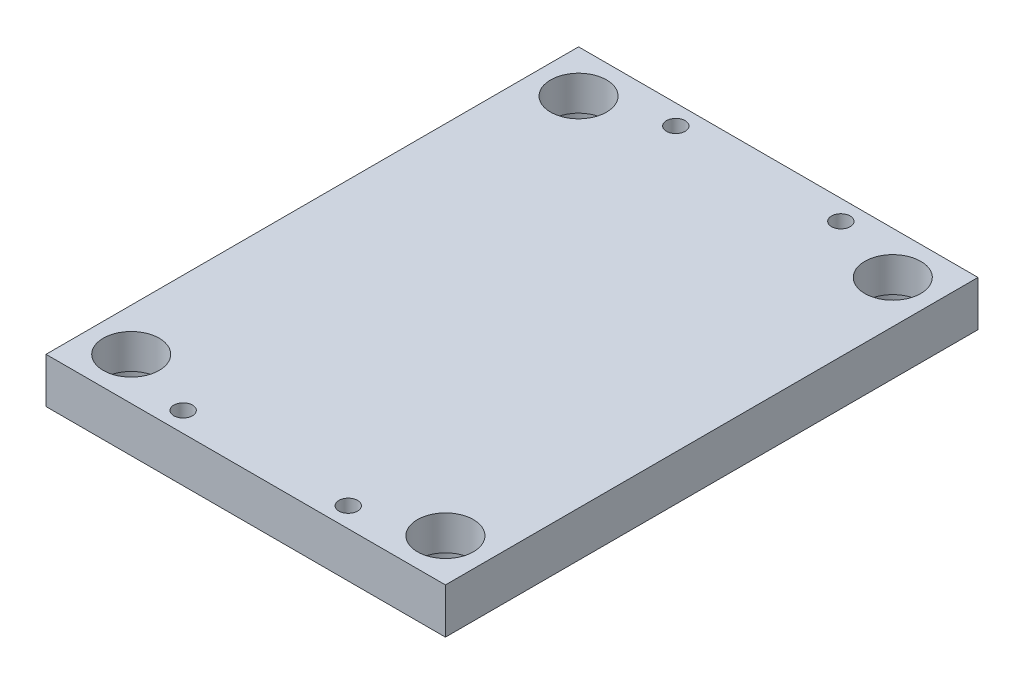
ISO-10303-21;
HEADER;
FILE_DESCRIPTION(('STEP AP214'),'2;1');
FILE_NAME('part.step','',(''),(''),'','','');
FILE_SCHEMA(('AUTOMOTIVE_DESIGN { 1 0 10303 214 1 1 1 1 }'));
ENDSEC;
DATA;
#1=APPLICATION_CONTEXT('core data for automotive mechanical design processes');
#2=APPLICATION_PROTOCOL_DEFINITION('international standard','automotive_design',2000,#1);
#3=PRODUCT_CONTEXT('',#1,'mechanical');
#4=PRODUCT('Part','Part','',(#3));
#5=PRODUCT_RELATED_PRODUCT_CATEGORY('part','',(#4));
#6=PRODUCT_DEFINITION_FORMATION('','',#4);
#7=PRODUCT_DEFINITION_CONTEXT('part definition',#1,'design');
#8=PRODUCT_DEFINITION('design','',#6,#7);
#9=PRODUCT_DEFINITION_SHAPE('','',#8);
#10=(LENGTH_UNIT() NAMED_UNIT(*) SI_UNIT(.MILLI.,.METRE.));
#11=(NAMED_UNIT(*) PLANE_ANGLE_UNIT() SI_UNIT($,.RADIAN.));
#12=(NAMED_UNIT(*) SI_UNIT($,.STERADIAN.) SOLID_ANGLE_UNIT());
#13=UNCERTAINTY_MEASURE_WITH_UNIT(LENGTH_MEASURE(1.E-05),#10,'distance_accuracy_value','');
#14=(GEOMETRIC_REPRESENTATION_CONTEXT(3) GLOBAL_UNCERTAINTY_ASSIGNED_CONTEXT((#13)) GLOBAL_UNIT_ASSIGNED_CONTEXT((#10,
#11,#12)) REPRESENTATION_CONTEXT('',''));
#15=CARTESIAN_POINT('',(0.,0.,0.));
#16=DIRECTION('',(0.,0.,1.));
#17=DIRECTION('',(1.,0.,0.));
#18=AXIS2_PLACEMENT_3D('',#15,#16,#17);
#19=CARTESIAN_POINT('',(-150.,34.,-200.));
#20=DIRECTION('',(1.,0.,0.));
#21=DIRECTION('',(0.,0.,-1.));
#22=AXIS2_PLACEMENT_3D('',#19,#20,#21);
#23=PLANE('',#22);
#24=DIRECTION('',(0.,0.,1.));
#25=VECTOR('',#24,1.);
#26=CARTESIAN_POINT('',(-150.,0.,-200.));
#27=LINE('',#26,#25);
#28=CARTESIAN_POINT('',(-150.,0.,-200.));
#29=VERTEX_POINT('',#28);
#30=CARTESIAN_POINT('',(-150.,0.,200.));
#31=VERTEX_POINT('',#30);
#32=EDGE_CURVE('E130',#29,#31,#27,.T.);
#33=ORIENTED_EDGE('',*,*,#32,.T.);
#34=DIRECTION('',(0.,-1.,0.));
#35=VECTOR('',#34,1.);
#36=CARTESIAN_POINT('',(-150.,34.,200.));
#37=LINE('',#36,#35);
#38=CARTESIAN_POINT('',(-150.,34.,200.));
#39=VERTEX_POINT('',#38);
#40=EDGE_CURVE('E11',#39,#31,#37,.T.);
#41=ORIENTED_EDGE('',*,*,#40,.F.);
#42=DIRECTION('',(0.,0.,1.));
#43=VECTOR('',#42,1.);
#44=CARTESIAN_POINT('',(-150.,34.,-200.));
#45=LINE('',#44,#43);
#46=CARTESIAN_POINT('',(-150.,34.,-200.));
#47=VERTEX_POINT('',#46);
#48=EDGE_CURVE('E131',#47,#39,#45,.T.);
#49=ORIENTED_EDGE('',*,*,#48,.F.);
#50=DIRECTION('',(0.,-1.,0.));
#51=VECTOR('',#50,1.);
#52=CARTESIAN_POINT('',(-150.,34.,-200.));
#53=LINE('',#52,#51);
#54=EDGE_CURVE('E137',#47,#29,#53,.T.);
#55=ORIENTED_EDGE('',*,*,#54,.T.);
#56=EDGE_LOOP('',(#33,#41,#49,#55));
#57=FACE_BOUND('',#56,.T.);
#58=ADVANCED_FACE('F32',(#57),#23,.F.);
#59=CARTESIAN_POINT('',(-150.,34.,200.));
#60=DIRECTION('',(0.,0.,-1.));
#61=DIRECTION('',(-1.,0.,0.));
#62=AXIS2_PLACEMENT_3D('',#59,#60,#61);
#63=PLANE('',#62);
#64=DIRECTION('',(1.,0.,0.));
#65=VECTOR('',#64,1.);
#66=CARTESIAN_POINT('',(-150.,0.,200.));
#67=LINE('',#66,#65);
#68=CARTESIAN_POINT('',(150.,0.,200.));
#69=VERTEX_POINT('',#68);
#70=EDGE_CURVE('E140',#31,#69,#67,.T.);
#71=ORIENTED_EDGE('',*,*,#70,.T.);
#72=DIRECTION('',(0.,-1.,0.));
#73=VECTOR('',#72,1.);
#74=CARTESIAN_POINT('',(150.,34.,200.));
#75=LINE('',#74,#73);
#76=CARTESIAN_POINT('',(150.,34.,200.));
#77=VERTEX_POINT('',#76);
#78=EDGE_CURVE('E40',#77,#69,#75,.T.);
#79=ORIENTED_EDGE('',*,*,#78,.F.);
#80=DIRECTION('',(1.,0.,0.));
#81=VECTOR('',#80,1.);
#82=CARTESIAN_POINT('',(-150.,34.,200.));
#83=LINE('',#82,#81);
#84=EDGE_CURVE('E79',#39,#77,#83,.T.);
#85=ORIENTED_EDGE('',*,*,#84,.F.);
#86=ORIENTED_EDGE('',*,*,#40,.T.);
#87=EDGE_LOOP('',(#71,#79,#85,#86));
#88=FACE_BOUND('',#87,.T.);
#89=ADVANCED_FACE('F164',(#88),#63,.F.);
#90=CARTESIAN_POINT('',(150.,34.,-200.));
#91=DIRECTION('',(-1.,0.,0.));
#92=DIRECTION('',(0.,0.,1.));
#93=AXIS2_PLACEMENT_3D('',#90,#91,#92);
#94=PLANE('',#93);
#95=DIRECTION('',(0.,0.,-1.));
#96=VECTOR('',#95,1.);
#97=CARTESIAN_POINT('',(150.,0.,-200.));
#98=LINE('',#97,#96);
#99=CARTESIAN_POINT('',(150.,0.,-200.));
#100=VERTEX_POINT('',#99);
#101=EDGE_CURVE('E66',#69,#100,#98,.T.);
#102=ORIENTED_EDGE('',*,*,#101,.T.);
#103=DIRECTION('',(0.,-1.,0.));
#104=VECTOR('',#103,1.);
#105=CARTESIAN_POINT('',(150.,34.,-200.));
#106=LINE('',#105,#104);
#107=CARTESIAN_POINT('',(150.,34.,-200.));
#108=VERTEX_POINT('',#107);
#109=EDGE_CURVE('E145',#108,#100,#106,.T.);
#110=ORIENTED_EDGE('',*,*,#109,.F.);
#111=DIRECTION('',(0.,0.,-1.));
#112=VECTOR('',#111,1.);
#113=CARTESIAN_POINT('',(150.,34.,-200.));
#114=LINE('',#113,#112);
#115=EDGE_CURVE('E134',#77,#108,#114,.T.);
#116=ORIENTED_EDGE('',*,*,#115,.F.);
#117=ORIENTED_EDGE('',*,*,#78,.T.);
#118=EDGE_LOOP('',(#102,#110,#116,#117));
#119=FACE_BOUND('',#118,.T.);
#120=ADVANCED_FACE('F147',(#119),#94,.F.);
#121=CARTESIAN_POINT('',(-150.,34.,-200.));
#122=DIRECTION('',(0.,0.,1.));
#123=DIRECTION('',(1.,0.,0.));
#124=AXIS2_PLACEMENT_3D('',#121,#122,#123);
#125=PLANE('',#124);
#126=DIRECTION('',(-1.,0.,0.));
#127=VECTOR('',#126,1.);
#128=CARTESIAN_POINT('',(-150.,0.,-200.));
#129=LINE('',#128,#127);
#130=EDGE_CURVE('E72',#100,#29,#129,.T.);
#131=ORIENTED_EDGE('',*,*,#130,.T.);
#132=ORIENTED_EDGE('',*,*,#54,.F.);
#133=DIRECTION('',(-1.,0.,0.));
#134=VECTOR('',#133,1.);
#135=CARTESIAN_POINT('',(-150.,34.,-200.));
#136=LINE('',#135,#134);
#137=EDGE_CURVE('E48',#108,#47,#136,.T.);
#138=ORIENTED_EDGE('',*,*,#137,.F.);
#139=ORIENTED_EDGE('',*,*,#109,.T.);
#140=EDGE_LOOP('',(#131,#132,#138,#139));
#141=FACE_BOUND('',#140,.T.);
#142=ADVANCED_FACE('F154',(#141),#125,.F.);
#143=CARTESIAN_POINT('',(-150.,34.,200.));
#144=DIRECTION('',(0.,1.,0.));
#145=DIRECTION('',(0.,0.,1.));
#146=AXIS2_PLACEMENT_3D('',#143,#144,#145);
#147=PLANE('',#146);
#148=CARTESIAN_POINT('',(-62.,34.,185.));
#149=DIRECTION('',(0.,1.,0.));
#150=DIRECTION('',(0.,0.,1.));
#151=AXIS2_PLACEMENT_3D('',#148,#149,#150);
#152=CIRCLE('',#151,7.00000000000001);
#153=CARTESIAN_POINT('',(-62.,34.,192.));
#154=VERTEX_POINT('',#153);
#155=EDGE_CURVE('E439',#154,#154,#152,.T.);
#156=ORIENTED_EDGE('',*,*,#155,.F.);
#157=EDGE_LOOP('',(#156));
#158=FACE_BOUND('',#157,.T.);
#159=CARTESIAN_POINT('',(-62.,34.,-185.));
#160=DIRECTION('',(0.,1.,0.));
#161=DIRECTION('',(0.,0.,1.));
#162=AXIS2_PLACEMENT_3D('',#159,#160,#161);
#163=CIRCLE('',#162,7.00000000000001);
#164=CARTESIAN_POINT('',(-62.,34.,-178.));
#165=VERTEX_POINT('',#164);
#166=EDGE_CURVE('E449',#165,#165,#163,.T.);
#167=ORIENTED_EDGE('',*,*,#166,.F.);
#168=EDGE_LOOP('',(#167));
#169=FACE_BOUND('',#168,.T.);
#170=CARTESIAN_POINT('',(62.,34.,185.));
#171=DIRECTION('',(0.,1.,0.));
#172=DIRECTION('',(0.,0.,1.));
#173=AXIS2_PLACEMENT_3D('',#170,#171,#172);
#174=CIRCLE('',#173,7.00000000000001);
#175=CARTESIAN_POINT('',(62.,34.,192.));
#176=VERTEX_POINT('',#175);
#177=EDGE_CURVE('E455',#176,#176,#174,.T.);
#178=ORIENTED_EDGE('',*,*,#177,.F.);
#179=EDGE_LOOP('',(#178));
#180=FACE_BOUND('',#179,.T.);
#181=CARTESIAN_POINT('',(62.,34.,-185.));
#182=DIRECTION('',(0.,1.,0.));
#183=DIRECTION('',(0.,0.,1.));
#184=AXIS2_PLACEMENT_3D('',#181,#182,#183);
#185=CIRCLE('',#184,7.00000000000001);
#186=CARTESIAN_POINT('',(62.,34.,-178.));
#187=VERTEX_POINT('',#186);
#188=EDGE_CURVE('E461',#187,#187,#185,.T.);
#189=ORIENTED_EDGE('',*,*,#188,.F.);
#190=EDGE_LOOP('',(#189));
#191=FACE_BOUND('',#190,.T.);
#192=CARTESIAN_POINT('',(118.,34.,168.));
#193=DIRECTION('',(0.,-1.,0.));
#194=DIRECTION('',(0.,0.,-1.));
#195=AXIS2_PLACEMENT_3D('',#192,#193,#194);
#196=CIRCLE('',#195,21.);
#197=CARTESIAN_POINT('',(118.,34.,147.));
#198=VERTEX_POINT('',#197);
#199=EDGE_CURVE('E473',#198,#198,#196,.T.);
#200=ORIENTED_EDGE('',*,*,#199,.T.);
#201=EDGE_LOOP('',(#200));
#202=FACE_BOUND('',#201,.T.);
#203=CARTESIAN_POINT('',(118.,34.,-168.));
#204=DIRECTION('',(0.,-1.,0.));
#205=DIRECTION('',(0.,0.,-1.));
#206=AXIS2_PLACEMENT_3D('',#203,#204,#205);
#207=CIRCLE('',#206,21.);
#208=CARTESIAN_POINT('',(118.,34.,-189.));
#209=VERTEX_POINT('',#208);
#210=EDGE_CURVE('E485',#209,#209,#207,.T.);
#211=ORIENTED_EDGE('',*,*,#210,.T.);
#212=EDGE_LOOP('',(#211));
#213=FACE_BOUND('',#212,.T.);
#214=CARTESIAN_POINT('',(-118.,34.,-168.));
#215=DIRECTION('',(0.,-1.,0.));
#216=DIRECTION('',(0.,0.,-1.));
#217=AXIS2_PLACEMENT_3D('',#214,#215,#216);
#218=CIRCLE('',#217,21.);
#219=CARTESIAN_POINT('',(-118.,34.,-189.));
#220=VERTEX_POINT('',#219);
#221=EDGE_CURVE('E497',#220,#220,#218,.T.);
#222=ORIENTED_EDGE('',*,*,#221,.T.);
#223=EDGE_LOOP('',(#222));
#224=FACE_BOUND('',#223,.T.);
#225=CARTESIAN_POINT('',(-118.,34.,168.));
#226=DIRECTION('',(0.,-1.,0.));
#227=DIRECTION('',(0.,0.,-1.));
#228=AXIS2_PLACEMENT_3D('',#225,#226,#227);
#229=CIRCLE('',#228,21.);
#230=CARTESIAN_POINT('',(-118.,34.,147.));
#231=VERTEX_POINT('',#230);
#232=EDGE_CURVE('E103',#231,#231,#229,.T.);
#233=ORIENTED_EDGE('',*,*,#232,.T.);
#234=EDGE_LOOP('',(#233));
#235=FACE_BOUND('',#234,.T.);
#236=ORIENTED_EDGE('',*,*,#48,.T.);
#237=ORIENTED_EDGE('',*,*,#84,.T.);
#238=ORIENTED_EDGE('',*,*,#115,.T.);
#239=ORIENTED_EDGE('',*,*,#137,.T.);
#240=EDGE_LOOP('',(#236,#237,#238,#239));
#241=FACE_BOUND('',#240,.T.);
#242=ADVANCED_FACE('F156',(#158,#169,#180,#191,#202,#213,#224,#235,#241),#147,.T.);
#243=CARTESIAN_POINT('',(-150.,0.,200.));
#244=DIRECTION('',(0.,1.,0.));
#245=DIRECTION('',(0.,0.,1.));
#246=AXIS2_PLACEMENT_3D('',#243,#244,#245);
#247=PLANE('',#246);
#248=CARTESIAN_POINT('',(-62.,0.,185.));
#249=DIRECTION('',(0.,-1.,0.));
#250=DIRECTION('',(0.,0.,-1.));
#251=AXIS2_PLACEMENT_3D('',#248,#249,#250);
#252=CIRCLE('',#251,7.00000000000001);
#253=CARTESIAN_POINT('',(-62.,0.,178.));
#254=VERTEX_POINT('',#253);
#255=EDGE_CURVE('E442',#254,#254,#252,.T.);
#256=ORIENTED_EDGE('',*,*,#255,.F.);
#257=EDGE_LOOP('',(#256));
#258=FACE_BOUND('',#257,.T.);
#259=CARTESIAN_POINT('',(-62.,0.,-185.));
#260=DIRECTION('',(0.,-1.,0.));
#261=DIRECTION('',(0.,0.,-1.));
#262=AXIS2_PLACEMENT_3D('',#259,#260,#261);
#263=CIRCLE('',#262,7.00000000000001);
#264=CARTESIAN_POINT('',(-62.,0.,-192.));
#265=VERTEX_POINT('',#264);
#266=EDGE_CURVE('E444',#265,#265,#263,.T.);
#267=ORIENTED_EDGE('',*,*,#266,.F.);
#268=EDGE_LOOP('',(#267));
#269=FACE_BOUND('',#268,.T.);
#270=CARTESIAN_POINT('',(62.,0.,185.));
#271=DIRECTION('',(0.,-1.,0.));
#272=DIRECTION('',(0.,0.,-1.));
#273=AXIS2_PLACEMENT_3D('',#270,#271,#272);
#274=CIRCLE('',#273,7.00000000000001);
#275=CARTESIAN_POINT('',(62.,0.,178.));
#276=VERTEX_POINT('',#275);
#277=EDGE_CURVE('E452',#276,#276,#274,.T.);
#278=ORIENTED_EDGE('',*,*,#277,.F.);
#279=EDGE_LOOP('',(#278));
#280=FACE_BOUND('',#279,.T.);
#281=CARTESIAN_POINT('',(62.,0.,-185.));
#282=DIRECTION('',(0.,-1.,0.));
#283=DIRECTION('',(0.,0.,-1.));
#284=AXIS2_PLACEMENT_3D('',#281,#282,#283);
#285=CIRCLE('',#284,7.00000000000001);
#286=CARTESIAN_POINT('',(62.,0.,-192.));
#287=VERTEX_POINT('',#286);
#288=EDGE_CURVE('E458',#287,#287,#285,.T.);
#289=ORIENTED_EDGE('',*,*,#288,.F.);
#290=EDGE_LOOP('',(#289));
#291=FACE_BOUND('',#290,.T.);
#292=CARTESIAN_POINT('',(118.,0.,168.));
#293=DIRECTION('',(0.,-1.,0.));
#294=DIRECTION('',(0.,0.,-1.));
#295=AXIS2_PLACEMENT_3D('',#292,#293,#294);
#296=CIRCLE('',#295,24.);
#297=CARTESIAN_POINT('',(118.,0.,144.));
#298=VERTEX_POINT('',#297);
#299=EDGE_CURVE('E464',#298,#298,#296,.T.);
#300=ORIENTED_EDGE('',*,*,#299,.F.);
#301=EDGE_LOOP('',(#300));
#302=FACE_BOUND('',#301,.T.);
#303=CARTESIAN_POINT('',(118.,0.,-168.));
#304=DIRECTION('',(0.,-1.,0.));
#305=DIRECTION('',(0.,0.,-1.));
#306=AXIS2_PLACEMENT_3D('',#303,#304,#305);
#307=CIRCLE('',#306,24.);
#308=CARTESIAN_POINT('',(118.,0.,-192.));
#309=VERTEX_POINT('',#308);
#310=EDGE_CURVE('E476',#309,#309,#307,.T.);
#311=ORIENTED_EDGE('',*,*,#310,.F.);
#312=EDGE_LOOP('',(#311));
#313=FACE_BOUND('',#312,.T.);
#314=CARTESIAN_POINT('',(-118.,0.,-168.));
#315=DIRECTION('',(0.,-1.,0.));
#316=DIRECTION('',(0.,0.,-1.));
#317=AXIS2_PLACEMENT_3D('',#314,#315,#316);
#318=CIRCLE('',#317,24.);
#319=CARTESIAN_POINT('',(-118.,0.,-192.));
#320=VERTEX_POINT('',#319);
#321=EDGE_CURVE('E488',#320,#320,#318,.T.);
#322=ORIENTED_EDGE('',*,*,#321,.F.);
#323=EDGE_LOOP('',(#322));
#324=FACE_BOUND('',#323,.T.);
#325=CARTESIAN_POINT('',(-118.,0.,168.));
#326=DIRECTION('',(0.,-1.,0.));
#327=DIRECTION('',(0.,0.,-1.));
#328=AXIS2_PLACEMENT_3D('',#325,#326,#327);
#329=CIRCLE('',#328,24.);
#330=CARTESIAN_POINT('',(-118.,0.,144.));
#331=VERTEX_POINT('',#330);
#332=EDGE_CURVE('E500',#331,#331,#329,.T.);
#333=ORIENTED_EDGE('',*,*,#332,.F.);
#334=EDGE_LOOP('',(#333));
#335=FACE_BOUND('',#334,.T.);
#336=CARTESIAN_POINT('',(-118.,0.,119.));
#337=DIRECTION('',(0.,-1.,0.));
#338=DIRECTION('',(0.,0.,-1.));
#339=AXIS2_PLACEMENT_3D('',#336,#337,#338);
#340=CIRCLE('',#339,6.99999999999999);
#341=CARTESIAN_POINT('',(-118.,0.,112.));
#342=VERTEX_POINT('',#341);
#343=EDGE_CURVE('E102',#342,#342,#340,.T.);
#344=ORIENTED_EDGE('',*,*,#343,.F.);
#345=EDGE_LOOP('',(#344));
#346=FACE_BOUND('',#345,.T.);
#347=CARTESIAN_POINT('',(118.,0.,119.));
#348=DIRECTION('',(0.,-1.,0.));
#349=DIRECTION('',(0.,0.,-1.));
#350=AXIS2_PLACEMENT_3D('',#347,#348,#349);
#351=CIRCLE('',#350,6.99999999999999);
#352=CARTESIAN_POINT('',(118.,0.,112.));
#353=VERTEX_POINT('',#352);
#354=EDGE_CURVE('E115',#353,#353,#351,.T.);
#355=ORIENTED_EDGE('',*,*,#354,.F.);
#356=EDGE_LOOP('',(#355));
#357=FACE_BOUND('',#356,.T.);
#358=CARTESIAN_POINT('',(-118.,0.,-119.));
#359=DIRECTION('',(0.,-1.,0.));
#360=DIRECTION('',(0.,0.,-1.));
#361=AXIS2_PLACEMENT_3D('',#358,#359,#360);
#362=CIRCLE('',#361,6.99999999999999);
#363=CARTESIAN_POINT('',(-118.,0.,-126.));
#364=VERTEX_POINT('',#363);
#365=EDGE_CURVE('E121',#364,#364,#362,.T.);
#366=ORIENTED_EDGE('',*,*,#365,.F.);
#367=EDGE_LOOP('',(#366));
#368=FACE_BOUND('',#367,.T.);
#369=CARTESIAN_POINT('',(118.,0.,-119.));
#370=DIRECTION('',(0.,-1.,0.));
#371=DIRECTION('',(0.,0.,-1.));
#372=AXIS2_PLACEMENT_3D('',#369,#370,#371);
#373=CIRCLE('',#372,6.99999999999999);
#374=CARTESIAN_POINT('',(118.,0.,-126.));
#375=VERTEX_POINT('',#374);
#376=EDGE_CURVE('E127',#375,#375,#373,.T.);
#377=ORIENTED_EDGE('',*,*,#376,.F.);
#378=EDGE_LOOP('',(#377));
#379=FACE_BOUND('',#378,.T.);
#380=ORIENTED_EDGE('',*,*,#32,.F.);
#381=ORIENTED_EDGE('',*,*,#130,.F.);
#382=ORIENTED_EDGE('',*,*,#101,.F.);
#383=ORIENTED_EDGE('',*,*,#70,.F.);
#384=EDGE_LOOP('',(#380,#381,#382,#383));
#385=FACE_BOUND('',#384,.T.);
#386=ADVANCED_FACE('F150',(#258,#269,#280,#291,#302,#313,#324,#335,#346,#357,#368,#379,#385),
#247,.F.);
#387=CARTESIAN_POINT('',(118.,0.,-119.));
#388=DIRECTION('',(0.,-1.,0.));
#389=DIRECTION('',(0.,0.,-1.));
#390=AXIS2_PLACEMENT_3D('',#387,#388,#389);
#391=CYLINDRICAL_SURFACE('',#390,6.99999999999999);
#392=CARTESIAN_POINT('',(118.,28.,-119.));
#393=DIRECTION('',(0.,-1.,0.));
#394=DIRECTION('',(0.,0.,-1.));
#395=AXIS2_PLACEMENT_3D('',#392,#393,#394);
#396=CIRCLE('',#395,6.99999999999999);
#397=CARTESIAN_POINT('',(118.,28.,-126.));
#398=VERTEX_POINT('',#397);
#399=EDGE_CURVE('E124',#398,#398,#396,.T.);
#400=ORIENTED_EDGE('',*,*,#399,.F.);
#401=EDGE_LOOP('',(#400));
#402=FACE_BOUND('',#401,.T.);
#403=ORIENTED_EDGE('',*,*,#376,.T.);
#404=EDGE_LOOP('',(#403));
#405=FACE_BOUND('',#404,.T.);
#406=ADVANCED_FACE('F187',(#402,#405),#391,.F.);
#407=CARTESIAN_POINT('',(118.,28.,-119.));
#408=DIRECTION('',(0.,-1.,0.));
#409=DIRECTION('',(0.,0.,-1.));
#410=AXIS2_PLACEMENT_3D('',#407,#408,#409);
#411=CONICAL_SURFACE('',#410,6.99999999999999,1.02974425867665);
#412=CARTESIAN_POINT('',(118.,32.2060243331929,-119.));
#413=VERTEX_POINT('',#412);
#414=VERTEX_LOOP('',#413);
#415=FACE_BOUND('',#414,.T.);
#416=ORIENTED_EDGE('',*,*,#399,.T.);
#417=EDGE_LOOP('',(#416));
#418=FACE_BOUND('',#417,.T.);
#419=ADVANCED_FACE('F193',(#415,#418),#411,.F.);
#420=CARTESIAN_POINT('',(-118.,0.,-119.));
#421=DIRECTION('',(0.,-1.,0.));
#422=DIRECTION('',(0.,0.,-1.));
#423=AXIS2_PLACEMENT_3D('',#420,#421,#422);
#424=CYLINDRICAL_SURFACE('',#423,6.99999999999999);
#425=CARTESIAN_POINT('',(-118.,28.,-119.));
#426=DIRECTION('',(0.,-1.,0.));
#427=DIRECTION('',(0.,0.,-1.));
#428=AXIS2_PLACEMENT_3D('',#425,#426,#427);
#429=CIRCLE('',#428,6.99999999999999);
#430=CARTESIAN_POINT('',(-118.,28.,-126.));
#431=VERTEX_POINT('',#430);
#432=EDGE_CURVE('E118',#431,#431,#429,.T.);
#433=ORIENTED_EDGE('',*,*,#432,.F.);
#434=EDGE_LOOP('',(#433));
#435=FACE_BOUND('',#434,.T.);
#436=ORIENTED_EDGE('',*,*,#365,.T.);
#437=EDGE_LOOP('',(#436));
#438=FACE_BOUND('',#437,.T.);
#439=ADVANCED_FACE('F205',(#435,#438),#424,.F.);
#440=CARTESIAN_POINT('',(-118.,28.,-119.));
#441=DIRECTION('',(0.,-1.,0.));
#442=DIRECTION('',(0.,0.,-1.));
#443=AXIS2_PLACEMENT_3D('',#440,#441,#442);
#444=CONICAL_SURFACE('',#443,6.99999999999999,1.02974425867665);
#445=CARTESIAN_POINT('',(-118.,32.2060243331929,-119.));
#446=VERTEX_POINT('',#445);
#447=VERTEX_LOOP('',#446);
#448=FACE_BOUND('',#447,.T.);
#449=ORIENTED_EDGE('',*,*,#432,.T.);
#450=EDGE_LOOP('',(#449));
#451=FACE_BOUND('',#450,.T.);
#452=ADVANCED_FACE('F215',(#448,#451),#444,.F.);
#453=CARTESIAN_POINT('',(118.,0.,119.));
#454=DIRECTION('',(0.,-1.,0.));
#455=DIRECTION('',(0.,0.,-1.));
#456=AXIS2_PLACEMENT_3D('',#453,#454,#455);
#457=CYLINDRICAL_SURFACE('',#456,6.99999999999999);
#458=CARTESIAN_POINT('',(118.,28.,119.));
#459=DIRECTION('',(0.,-1.,0.));
#460=DIRECTION('',(0.,0.,-1.));
#461=AXIS2_PLACEMENT_3D('',#458,#459,#460);
#462=CIRCLE('',#461,6.99999999999999);
#463=CARTESIAN_POINT('',(118.,28.,112.));
#464=VERTEX_POINT('',#463);
#465=EDGE_CURVE('E106',#464,#464,#462,.T.);
#466=ORIENTED_EDGE('',*,*,#465,.F.);
#467=EDGE_LOOP('',(#466));
#468=FACE_BOUND('',#467,.T.);
#469=ORIENTED_EDGE('',*,*,#354,.T.);
#470=EDGE_LOOP('',(#469));
#471=FACE_BOUND('',#470,.T.);
#472=ADVANCED_FACE('F226',(#468,#471),#457,.F.);
#473=CARTESIAN_POINT('',(118.,28.,119.));
#474=DIRECTION('',(0.,-1.,0.));
#475=DIRECTION('',(0.,0.,-1.));
#476=AXIS2_PLACEMENT_3D('',#473,#474,#475);
#477=CONICAL_SURFACE('',#476,6.99999999999999,1.02974425867665);
#478=CARTESIAN_POINT('',(118.,32.2060243331929,119.));
#479=VERTEX_POINT('',#478);
#480=VERTEX_LOOP('',#479);
#481=FACE_BOUND('',#480,.T.);
#482=ORIENTED_EDGE('',*,*,#465,.T.);
#483=EDGE_LOOP('',(#482));
#484=FACE_BOUND('',#483,.T.);
#485=ADVANCED_FACE('F236',(#481,#484),#477,.F.);
#486=CARTESIAN_POINT('',(-118.,0.,119.));
#487=DIRECTION('',(0.,-1.,0.));
#488=DIRECTION('',(0.,0.,-1.));
#489=AXIS2_PLACEMENT_3D('',#486,#487,#488);
#490=CYLINDRICAL_SURFACE('',#489,6.99999999999999);
#491=CARTESIAN_POINT('',(-118.,28.,119.));
#492=DIRECTION('',(0.,-1.,0.));
#493=DIRECTION('',(0.,0.,-1.));
#494=AXIS2_PLACEMENT_3D('',#491,#492,#493);
#495=CIRCLE('',#494,6.99999999999999);
#496=CARTESIAN_POINT('',(-118.,28.,112.));
#497=VERTEX_POINT('',#496);
#498=EDGE_CURVE('E100',#497,#497,#495,.T.);
#499=ORIENTED_EDGE('',*,*,#498,.F.);
#500=EDGE_LOOP('',(#499));
#501=FACE_BOUND('',#500,.T.);
#502=ORIENTED_EDGE('',*,*,#343,.T.);
#503=EDGE_LOOP('',(#502));
#504=FACE_BOUND('',#503,.T.);
#505=ADVANCED_FACE('F96',(#501,#504),#490,.F.);
#506=CARTESIAN_POINT('',(-118.,28.,119.));
#507=DIRECTION('',(0.,-1.,0.));
#508=DIRECTION('',(0.,0.,-1.));
#509=AXIS2_PLACEMENT_3D('',#506,#507,#508);
#510=CONICAL_SURFACE('',#509,6.99999999999999,1.02974425867665);
#511=CARTESIAN_POINT('',(-118.,32.2060243331929,119.));
#512=VERTEX_POINT('',#511);
#513=VERTEX_LOOP('',#512);
#514=FACE_BOUND('',#513,.T.);
#515=ORIENTED_EDGE('',*,*,#498,.T.);
#516=EDGE_LOOP('',(#515));
#517=FACE_BOUND('',#516,.T.);
#518=ADVANCED_FACE('F92',(#514,#517),#510,.F.);
#519=CARTESIAN_POINT('',(-118.,0.,168.));
#520=DIRECTION('',(0.,-1.,0.));
#521=DIRECTION('',(0.,0.,-1.));
#522=AXIS2_PLACEMENT_3D('',#519,#520,#521);
#523=CYLINDRICAL_SURFACE('',#522,21.);
#524=ORIENTED_EDGE('',*,*,#232,.F.);
#525=EDGE_LOOP('',(#524));
#526=FACE_BOUND('',#525,.T.);
#527=CARTESIAN_POINT('',(-118.,8.,168.));
#528=DIRECTION('',(0.,-1.,0.));
#529=DIRECTION('',(0.,0.,-1.));
#530=AXIS2_PLACEMENT_3D('',#527,#528,#529);
#531=CIRCLE('',#530,21.);
#532=CARTESIAN_POINT('',(-118.,8.,147.));
#533=VERTEX_POINT('',#532);
#534=EDGE_CURVE('E109',#533,#533,#531,.T.);
#535=ORIENTED_EDGE('',*,*,#534,.T.);
#536=EDGE_LOOP('',(#535));
#537=FACE_BOUND('',#536,.T.);
#538=ADVANCED_FACE('F95',(#526,#537),#523,.F.);
#539=CARTESIAN_POINT('',(-97.,8.,168.));
#540=DIRECTION('',(0.,1.,0.));
#541=DIRECTION('',(0.,0.,1.));
#542=AXIS2_PLACEMENT_3D('',#539,#540,#541);
#543=PLANE('',#542);
#544=ORIENTED_EDGE('',*,*,#534,.F.);
#545=EDGE_LOOP('',(#544));
#546=FACE_BOUND('',#545,.T.);
#547=CARTESIAN_POINT('',(-118.,8.,168.));
#548=DIRECTION('',(0.,-1.,0.));
#549=DIRECTION('',(0.,0.,-1.));
#550=AXIS2_PLACEMENT_3D('',#547,#548,#549);
#551=CIRCLE('',#550,24.);
#552=CARTESIAN_POINT('',(-118.,8.,144.));
#553=VERTEX_POINT('',#552);
#554=EDGE_CURVE('E503',#553,#553,#551,.T.);
#555=ORIENTED_EDGE('',*,*,#554,.T.);
#556=EDGE_LOOP('',(#555));
#557=FACE_BOUND('',#556,.T.);
#558=ADVANCED_FACE('F270',(#546,#557),#543,.F.);
#559=CARTESIAN_POINT('',(-118.,0.,168.));
#560=DIRECTION('',(0.,-1.,0.));
#561=DIRECTION('',(0.,0.,-1.));
#562=AXIS2_PLACEMENT_3D('',#559,#560,#561);
#563=CYLINDRICAL_SURFACE('',#562,24.);
#564=ORIENTED_EDGE('',*,*,#554,.F.);
#565=EDGE_LOOP('',(#564));
#566=FACE_BOUND('',#565,.T.);
#567=ORIENTED_EDGE('',*,*,#332,.T.);
#568=EDGE_LOOP('',(#567));
#569=FACE_BOUND('',#568,.T.);
#570=ADVANCED_FACE('F280',(#566,#569),#563,.F.);
#571=CARTESIAN_POINT('',(-118.,0.,-168.));
#572=DIRECTION('',(0.,-1.,0.));
#573=DIRECTION('',(0.,0.,-1.));
#574=AXIS2_PLACEMENT_3D('',#571,#572,#573);
#575=CYLINDRICAL_SURFACE('',#574,21.);
#576=ORIENTED_EDGE('',*,*,#221,.F.);
#577=EDGE_LOOP('',(#576));
#578=FACE_BOUND('',#577,.T.);
#579=CARTESIAN_POINT('',(-118.,8.,-168.));
#580=DIRECTION('',(0.,-1.,0.));
#581=DIRECTION('',(0.,0.,-1.));
#582=AXIS2_PLACEMENT_3D('',#579,#580,#581);
#583=CIRCLE('',#582,21.);
#584=CARTESIAN_POINT('',(-118.,8.,-189.));
#585=VERTEX_POINT('',#584);
#586=EDGE_CURVE('E494',#585,#585,#583,.T.);
#587=ORIENTED_EDGE('',*,*,#586,.T.);
#588=EDGE_LOOP('',(#587));
#589=FACE_BOUND('',#588,.T.);
#590=ADVANCED_FACE('F290',(#578,#589),#575,.F.);
#591=CARTESIAN_POINT('',(-97.,8.,-168.));
#592=DIRECTION('',(0.,1.,0.));
#593=DIRECTION('',(0.,0.,1.));
#594=AXIS2_PLACEMENT_3D('',#591,#592,#593);
#595=PLANE('',#594);
#596=ORIENTED_EDGE('',*,*,#586,.F.);
#597=EDGE_LOOP('',(#596));
#598=FACE_BOUND('',#597,.T.);
#599=CARTESIAN_POINT('',(-118.,8.,-168.));
#600=DIRECTION('',(0.,-1.,0.));
#601=DIRECTION('',(0.,0.,-1.));
#602=AXIS2_PLACEMENT_3D('',#599,#600,#601);
#603=CIRCLE('',#602,24.);
#604=CARTESIAN_POINT('',(-118.,8.,-192.));
#605=VERTEX_POINT('',#604);
#606=EDGE_CURVE('E491',#605,#605,#603,.T.);
#607=ORIENTED_EDGE('',*,*,#606,.T.);
#608=EDGE_LOOP('',(#607));
#609=FACE_BOUND('',#608,.T.);
#610=ADVANCED_FACE('F300',(#598,#609),#595,.F.);
#611=CARTESIAN_POINT('',(-118.,0.,-168.));
#612=DIRECTION('',(0.,-1.,0.));
#613=DIRECTION('',(0.,0.,-1.));
#614=AXIS2_PLACEMENT_3D('',#611,#612,#613);
#615=CYLINDRICAL_SURFACE('',#614,24.);
#616=ORIENTED_EDGE('',*,*,#606,.F.);
#617=EDGE_LOOP('',(#616));
#618=FACE_BOUND('',#617,.T.);
#619=ORIENTED_EDGE('',*,*,#321,.T.);
#620=EDGE_LOOP('',(#619));
#621=FACE_BOUND('',#620,.T.);
#622=ADVANCED_FACE('F310',(#618,#621),#615,.F.);
#623=CARTESIAN_POINT('',(118.,0.,-168.));
#624=DIRECTION('',(0.,-1.,0.));
#625=DIRECTION('',(0.,0.,-1.));
#626=AXIS2_PLACEMENT_3D('',#623,#624,#625);
#627=CYLINDRICAL_SURFACE('',#626,21.);
#628=ORIENTED_EDGE('',*,*,#210,.F.);
#629=EDGE_LOOP('',(#628));
#630=FACE_BOUND('',#629,.T.);
#631=CARTESIAN_POINT('',(118.,8.,-168.));
#632=DIRECTION('',(0.,-1.,0.));
#633=DIRECTION('',(0.,0.,-1.));
#634=AXIS2_PLACEMENT_3D('',#631,#632,#633);
#635=CIRCLE('',#634,21.);
#636=CARTESIAN_POINT('',(118.,8.,-189.));
#637=VERTEX_POINT('',#636);
#638=EDGE_CURVE('E482',#637,#637,#635,.T.);
#639=ORIENTED_EDGE('',*,*,#638,.T.);
#640=EDGE_LOOP('',(#639));
#641=FACE_BOUND('',#640,.T.);
#642=ADVANCED_FACE('F320',(#630,#641),#627,.F.);
#643=CARTESIAN_POINT('',(139.,8.,-168.));
#644=DIRECTION('',(0.,1.,0.));
#645=DIRECTION('',(0.,0.,1.));
#646=AXIS2_PLACEMENT_3D('',#643,#644,#645);
#647=PLANE('',#646);
#648=ORIENTED_EDGE('',*,*,#638,.F.);
#649=EDGE_LOOP('',(#648));
#650=FACE_BOUND('',#649,.T.);
#651=CARTESIAN_POINT('',(118.,8.,-168.));
#652=DIRECTION('',(0.,-1.,0.));
#653=DIRECTION('',(0.,0.,-1.));
#654=AXIS2_PLACEMENT_3D('',#651,#652,#653);
#655=CIRCLE('',#654,24.);
#656=CARTESIAN_POINT('',(118.,8.,-192.));
#657=VERTEX_POINT('',#656);
#658=EDGE_CURVE('E479',#657,#657,#655,.T.);
#659=ORIENTED_EDGE('',*,*,#658,.T.);
#660=EDGE_LOOP('',(#659));
#661=FACE_BOUND('',#660,.T.);
#662=ADVANCED_FACE('F330',(#650,#661),#647,.F.);
#663=CARTESIAN_POINT('',(118.,0.,-168.));
#664=DIRECTION('',(0.,-1.,0.));
#665=DIRECTION('',(0.,0.,-1.));
#666=AXIS2_PLACEMENT_3D('',#663,#664,#665);
#667=CYLINDRICAL_SURFACE('',#666,24.);
#668=ORIENTED_EDGE('',*,*,#658,.F.);
#669=EDGE_LOOP('',(#668));
#670=FACE_BOUND('',#669,.T.);
#671=ORIENTED_EDGE('',*,*,#310,.T.);
#672=EDGE_LOOP('',(#671));
#673=FACE_BOUND('',#672,.T.);
#674=ADVANCED_FACE('F340',(#670,#673),#667,.F.);
#675=CARTESIAN_POINT('',(118.,0.,168.));
#676=DIRECTION('',(0.,-1.,0.));
#677=DIRECTION('',(0.,0.,-1.));
#678=AXIS2_PLACEMENT_3D('',#675,#676,#677);
#679=CYLINDRICAL_SURFACE('',#678,21.);
#680=ORIENTED_EDGE('',*,*,#199,.F.);
#681=EDGE_LOOP('',(#680));
#682=FACE_BOUND('',#681,.T.);
#683=CARTESIAN_POINT('',(118.,8.,168.));
#684=DIRECTION('',(0.,-1.,0.));
#685=DIRECTION('',(0.,0.,-1.));
#686=AXIS2_PLACEMENT_3D('',#683,#684,#685);
#687=CIRCLE('',#686,21.);
#688=CARTESIAN_POINT('',(118.,8.,147.));
#689=VERTEX_POINT('',#688);
#690=EDGE_CURVE('E470',#689,#689,#687,.T.);
#691=ORIENTED_EDGE('',*,*,#690,.T.);
#692=EDGE_LOOP('',(#691));
#693=FACE_BOUND('',#692,.T.);
#694=ADVANCED_FACE('F350',(#682,#693),#679,.F.);
#695=CARTESIAN_POINT('',(139.,8.,168.));
#696=DIRECTION('',(0.,1.,0.));
#697=DIRECTION('',(0.,0.,1.));
#698=AXIS2_PLACEMENT_3D('',#695,#696,#697);
#699=PLANE('',#698);
#700=ORIENTED_EDGE('',*,*,#690,.F.);
#701=EDGE_LOOP('',(#700));
#702=FACE_BOUND('',#701,.T.);
#703=CARTESIAN_POINT('',(118.,8.,168.));
#704=DIRECTION('',(0.,-1.,0.));
#705=DIRECTION('',(0.,0.,-1.));
#706=AXIS2_PLACEMENT_3D('',#703,#704,#705);
#707=CIRCLE('',#706,24.);
#708=CARTESIAN_POINT('',(118.,8.,144.));
#709=VERTEX_POINT('',#708);
#710=EDGE_CURVE('E467',#709,#709,#707,.T.);
#711=ORIENTED_EDGE('',*,*,#710,.T.);
#712=EDGE_LOOP('',(#711));
#713=FACE_BOUND('',#712,.T.);
#714=ADVANCED_FACE('F360',(#702,#713),#699,.F.);
#715=CARTESIAN_POINT('',(118.,0.,168.));
#716=DIRECTION('',(0.,-1.,0.));
#717=DIRECTION('',(0.,0.,-1.));
#718=AXIS2_PLACEMENT_3D('',#715,#716,#717);
#719=CYLINDRICAL_SURFACE('',#718,24.);
#720=ORIENTED_EDGE('',*,*,#710,.F.);
#721=EDGE_LOOP('',(#720));
#722=FACE_BOUND('',#721,.T.);
#723=ORIENTED_EDGE('',*,*,#299,.T.);
#724=EDGE_LOOP('',(#723));
#725=FACE_BOUND('',#724,.T.);
#726=ADVANCED_FACE('F370',(#722,#725),#719,.F.);
#727=CARTESIAN_POINT('',(62.,0.,-185.));
#728=DIRECTION('',(0.,-1.,0.));
#729=DIRECTION('',(0.,0.,-1.));
#730=AXIS2_PLACEMENT_3D('',#727,#728,#729);
#731=CYLINDRICAL_SURFACE('',#730,7.00000000000001);
#732=ORIENTED_EDGE('',*,*,#188,.T.);
#733=EDGE_LOOP('',(#732));
#734=FACE_BOUND('',#733,.T.);
#735=ORIENTED_EDGE('',*,*,#288,.T.);
#736=EDGE_LOOP('',(#735));
#737=FACE_BOUND('',#736,.T.);
#738=ADVANCED_FACE('F380',(#734,#737),#731,.F.);
#739=CARTESIAN_POINT('',(62.,0.,185.));
#740=DIRECTION('',(0.,-1.,0.));
#741=DIRECTION('',(0.,0.,-1.));
#742=AXIS2_PLACEMENT_3D('',#739,#740,#741);
#743=CYLINDRICAL_SURFACE('',#742,7.00000000000001);
#744=ORIENTED_EDGE('',*,*,#177,.T.);
#745=EDGE_LOOP('',(#744));
#746=FACE_BOUND('',#745,.T.);
#747=ORIENTED_EDGE('',*,*,#277,.T.);
#748=EDGE_LOOP('',(#747));
#749=FACE_BOUND('',#748,.T.);
#750=ADVANCED_FACE('F402',(#746,#749),#743,.F.);
#751=CARTESIAN_POINT('',(-62.,0.,-185.));
#752=DIRECTION('',(0.,-1.,0.));
#753=DIRECTION('',(0.,0.,-1.));
#754=AXIS2_PLACEMENT_3D('',#751,#752,#753);
#755=CYLINDRICAL_SURFACE('',#754,7.00000000000001);
#756=ORIENTED_EDGE('',*,*,#166,.T.);
#757=EDGE_LOOP('',(#756));
#758=FACE_BOUND('',#757,.T.);
#759=ORIENTED_EDGE('',*,*,#266,.T.);
#760=EDGE_LOOP('',(#759));
#761=FACE_BOUND('',#760,.T.);
#762=ADVANCED_FACE('F412',(#758,#761),#755,.F.);
#763=CARTESIAN_POINT('',(-62.,0.,185.));
#764=DIRECTION('',(0.,-1.,0.));
#765=DIRECTION('',(0.,0.,-1.));
#766=AXIS2_PLACEMENT_3D('',#763,#764,#765);
#767=CYLINDRICAL_SURFACE('',#766,7.00000000000001);
#768=ORIENTED_EDGE('',*,*,#155,.T.);
#769=EDGE_LOOP('',(#768));
#770=FACE_BOUND('',#769,.T.);
#771=ORIENTED_EDGE('',*,*,#255,.T.);
#772=EDGE_LOOP('',(#771));
#773=FACE_BOUND('',#772,.T.);
#774=ADVANCED_FACE('F422',(#770,#773),#767,.F.);
#775=CLOSED_SHELL('',(#58,#89,#120,#142,#242,#386,#406,#419,#439,#452,#472,#485,#505,#518,#538,
#558,#570,#590,#610,#622,#642,#662,#674,#694,#714,#726,#738,#750,#762,#774));
#776=MANIFOLD_SOLID_BREP('B2',#775);
#777=ADVANCED_BREP_SHAPE_REPRESENTATION('',(#18,#776),#14);
#778=SHAPE_DEFINITION_REPRESENTATION(#9,#777);
ENDSEC;
END-ISO-10303-21;
